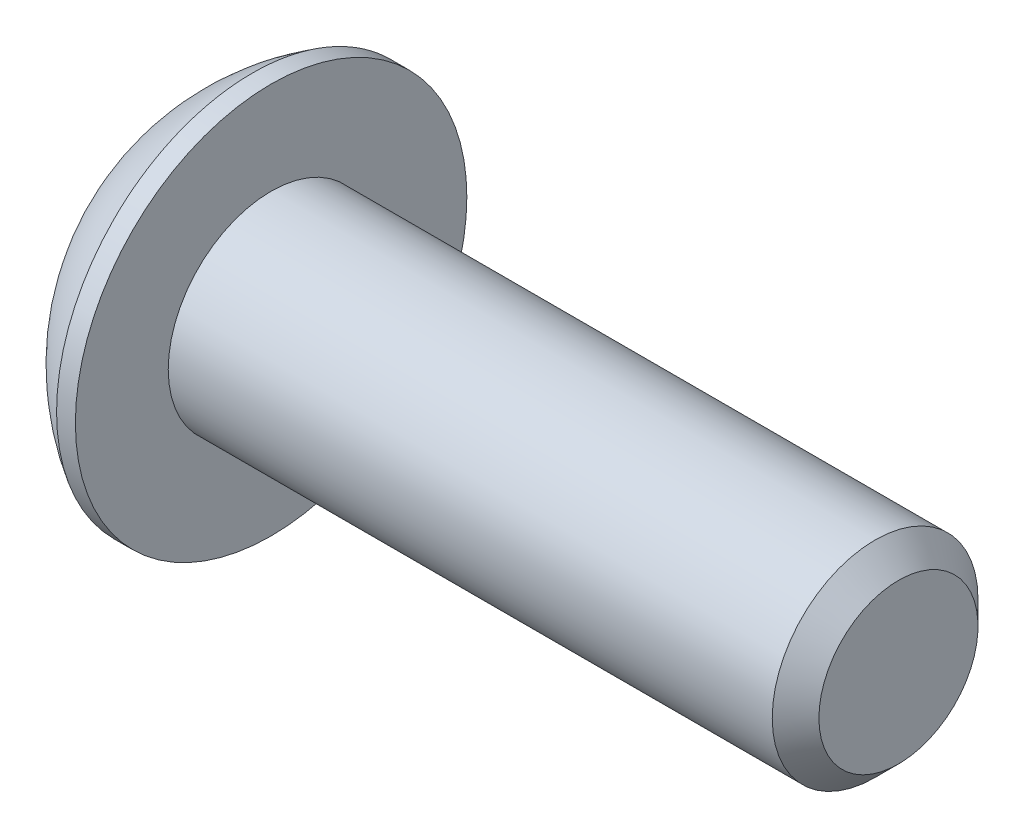
ISO-10303-21;
HEADER;
FILE_DESCRIPTION(('STEP AP214'),'2;1');
FILE_NAME('part.step','',(''),(''),'','','');
FILE_SCHEMA(('AUTOMOTIVE_DESIGN { 1 0 10303 214 1 1 1 1 }'));
ENDSEC;
DATA;
#1=APPLICATION_CONTEXT('core data for automotive mechanical design processes');
#2=APPLICATION_PROTOCOL_DEFINITION('international standard','automotive_design',2000,#1);
#3=PRODUCT_CONTEXT('',#1,'mechanical');
#4=PRODUCT('Part','Part','',(#3));
#5=PRODUCT_RELATED_PRODUCT_CATEGORY('part','',(#4));
#6=PRODUCT_DEFINITION_FORMATION('','',#4);
#7=PRODUCT_DEFINITION_CONTEXT('part definition',#1,'design');
#8=PRODUCT_DEFINITION('design','',#6,#7);
#9=PRODUCT_DEFINITION_SHAPE('','',#8);
#10=(LENGTH_UNIT() NAMED_UNIT(*) SI_UNIT(.MILLI.,.METRE.));
#11=(NAMED_UNIT(*) PLANE_ANGLE_UNIT() SI_UNIT($,.RADIAN.));
#12=(NAMED_UNIT(*) SI_UNIT($,.STERADIAN.) SOLID_ANGLE_UNIT());
#13=UNCERTAINTY_MEASURE_WITH_UNIT(LENGTH_MEASURE(1.E-05),#10,'distance_accuracy_value','');
#14=(GEOMETRIC_REPRESENTATION_CONTEXT(3) GLOBAL_UNCERTAINTY_ASSIGNED_CONTEXT((#13)) GLOBAL_UNIT_ASSIGNED_CONTEXT((#10,
#11,#12)) REPRESENTATION_CONTEXT('',''));
#15=CARTESIAN_POINT('',(0.,0.,0.));
#16=DIRECTION('',(0.,0.,1.));
#17=DIRECTION('',(1.,0.,0.));
#18=AXIS2_PLACEMENT_3D('',#15,#16,#17);
#19=CARTESIAN_POINT('',(1.32080000000034,0.,0.));
#20=DIRECTION('',(-1.,0.,0.));
#21=DIRECTION('',(0.,0.,1.));
#22=AXIS2_PLACEMENT_3D('',#19,#20,#21);
#23=CONICAL_SURFACE('',#22,1.1937999999998,1.04719755119608);
#24=CARTESIAN_POINT('',(2.01004075135902,0.,4.44089209850063E-13));
#25=VERTEX_POINT('',#24);
#26=VERTEX_LOOP('',#25);
#27=FACE_BOUND('',#26,.T.);
#28=CARTESIAN_POINT('',(1.32080000000009,0.,0.));
#29=DIRECTION('',(-1.,0.,0.));
#30=DIRECTION('',(0.,0.,1.));
#31=AXIS2_PLACEMENT_3D('',#28,#29,#30);
#32=CIRCLE('',#31,1.19380000000024);
#33=CARTESIAN_POINT('',(1.32080000000004,-1.03386112703797,0.59690000000006));
#34=VERTEX_POINT('',#33);
#35=CARTESIAN_POINT('',(1.32080000000004,0.,1.19380000000012));
#36=VERTEX_POINT('',#35);
#37=EDGE_CURVE('E18',#34,#36,#32,.T.);
#38=ORIENTED_EDGE('',*,*,#37,.T.);
#39=CARTESIAN_POINT('',(1.32080000000009,0.,0.));
#40=DIRECTION('',(-1.,0.,0.));
#41=DIRECTION('',(0.,0.,1.));
#42=AXIS2_PLACEMENT_3D('',#39,#40,#41);
#43=CIRCLE('',#42,1.19380000000024);
#44=CARTESIAN_POINT('',(1.32080000000004,1.03386112703797,0.596900000000061));
#45=VERTEX_POINT('',#44);
#46=EDGE_CURVE('E139',#36,#45,#43,.T.);
#47=ORIENTED_EDGE('',*,*,#46,.T.);
#48=CARTESIAN_POINT('',(1.32080000000009,0.,0.));
#49=DIRECTION('',(-1.,0.,0.));
#50=DIRECTION('',(0.,0.,1.));
#51=AXIS2_PLACEMENT_3D('',#48,#49,#50);
#52=CIRCLE('',#51,1.19380000000024);
#53=CARTESIAN_POINT('',(1.32080000000004,1.03386112703797,-0.596900000000061));
#54=VERTEX_POINT('',#53);
#55=EDGE_CURVE('E268',#45,#54,#52,.T.);
#56=ORIENTED_EDGE('',*,*,#55,.T.);
#57=CARTESIAN_POINT('',(1.32080000000009,0.,0.));
#58=DIRECTION('',(-1.,0.,0.));
#59=DIRECTION('',(0.,0.,1.));
#60=AXIS2_PLACEMENT_3D('',#57,#58,#59);
#61=CIRCLE('',#60,1.19380000000024);
#62=CARTESIAN_POINT('',(1.32080000000004,1.49457637585666E-12,-1.19380000000012));
#63=VERTEX_POINT('',#62);
#64=EDGE_CURVE('E266',#54,#63,#61,.T.);
#65=ORIENTED_EDGE('',*,*,#64,.T.);
#66=CARTESIAN_POINT('',(1.32080000000009,0.,0.));
#67=DIRECTION('',(-1.,0.,0.));
#68=DIRECTION('',(0.,0.,1.));
#69=AXIS2_PLACEMENT_3D('',#66,#67,#68);
#70=CIRCLE('',#69,1.19380000000024);
#71=CARTESIAN_POINT('',(1.32080000000004,-1.03386112703797,-0.59690000000006));
#72=VERTEX_POINT('',#71);
#73=EDGE_CURVE('E91',#63,#72,#70,.T.);
#74=ORIENTED_EDGE('',*,*,#73,.T.);
#75=CARTESIAN_POINT('',(1.32080000000009,0.,0.));
#76=DIRECTION('',(-1.,0.,0.));
#77=DIRECTION('',(0.,0.,1.));
#78=AXIS2_PLACEMENT_3D('',#75,#76,#77);
#79=CIRCLE('',#78,1.19380000000024);
#80=EDGE_CURVE('E87',#72,#34,#79,.T.);
#81=ORIENTED_EDGE('',*,*,#80,.T.);
#82=EDGE_LOOP('',(#38,#47,#56,#65,#74,#81));
#83=FACE_BOUND('',#82,.T.);
#84=ADVANCED_FACE('F14',(#27,#83),#23,.F.);
#85=CARTESIAN_POINT('',(1.3208,-2.06772225407572,-1.1938));
#86=DIRECTION('',(1.,0.,0.));
#87=DIRECTION('',(0.,0.,-1.));
#88=AXIS2_PLACEMENT_3D('',#85,#86,#87);
#89=PLANE('',#88);
#90=DIRECTION('',(0.,0.5,0.866025403784439));
#91=VECTOR('',#90,1.);
#92=CARTESIAN_POINT('',(1.3208,-1.37848150271715,0.));
#93=LINE('',#92,#91);
#94=CARTESIAN_POINT('',(1.3208,-0.689240751358574,1.1938));
#95=VERTEX_POINT('',#94);
#96=EDGE_CURVE('E99',#95,#34,#93,.F.);
#97=ORIENTED_EDGE('',*,*,#96,.F.);
#98=DIRECTION('',(0.,1.,0.));
#99=VECTOR('',#98,1.);
#100=CARTESIAN_POINT('',(1.3208,-0.689240751358574,1.1938));
#101=LINE('',#100,#99);
#102=EDGE_CURVE('E101',#36,#95,#101,.F.);
#103=ORIENTED_EDGE('',*,*,#102,.F.);
#104=ORIENTED_EDGE('',*,*,#37,.F.);
#105=EDGE_LOOP('',(#97,#103,#104));
#106=FACE_BOUND('',#105,.T.);
#107=ADVANCED_FACE('F97',(#106),#89,.F.);
#108=CARTESIAN_POINT('',(1.3208,-2.06772225407572,-1.1938));
#109=DIRECTION('',(1.,0.,0.));
#110=DIRECTION('',(0.,0.,-1.));
#111=AXIS2_PLACEMENT_3D('',#108,#109,#110);
#112=PLANE('',#111);
#113=DIRECTION('',(0.,-0.5,0.866025403784439));
#114=VECTOR('',#113,1.);
#115=CARTESIAN_POINT('',(1.3208,-0.689240751358574,-1.1938));
#116=LINE('',#115,#114);
#117=CARTESIAN_POINT('',(1.3208,-1.37848150271715,0.));
#118=VERTEX_POINT('',#117);
#119=EDGE_CURVE('E107',#118,#72,#116,.F.);
#120=ORIENTED_EDGE('',*,*,#119,.F.);
#121=DIRECTION('',(0.,0.5,0.866025403784439));
#122=VECTOR('',#121,1.);
#123=CARTESIAN_POINT('',(1.3208,-1.37848150271715,0.));
#124=LINE('',#123,#122);
#125=EDGE_CURVE('E104',#34,#118,#124,.F.);
#126=ORIENTED_EDGE('',*,*,#125,.F.);
#127=ORIENTED_EDGE('',*,*,#80,.F.);
#128=EDGE_LOOP('',(#120,#126,#127));
#129=FACE_BOUND('',#128,.T.);
#130=ADVANCED_FACE('F105',(#129),#112,.F.);
#131=CARTESIAN_POINT('',(1.3208,-2.06772225407572,-1.1938));
#132=DIRECTION('',(1.,0.,0.));
#133=DIRECTION('',(0.,0.,-1.));
#134=AXIS2_PLACEMENT_3D('',#131,#132,#133);
#135=PLANE('',#134);
#136=DIRECTION('',(0.,1.,0.));
#137=VECTOR('',#136,1.);
#138=CARTESIAN_POINT('',(1.3208,0.689240751358577,-1.1938));
#139=LINE('',#138,#137);
#140=CARTESIAN_POINT('',(1.3208,-0.689240751358574,-1.1938));
#141=VERTEX_POINT('',#140);
#142=EDGE_CURVE('E235',#141,#63,#139,.T.);
#143=ORIENTED_EDGE('',*,*,#142,.F.);
#144=DIRECTION('',(0.,-0.5,0.866025403784439));
#145=VECTOR('',#144,1.);
#146=CARTESIAN_POINT('',(1.3208,-0.689240751358574,-1.1938));
#147=LINE('',#146,#145);
#148=EDGE_CURVE('E240',#72,#141,#147,.F.);
#149=ORIENTED_EDGE('',*,*,#148,.F.);
#150=ORIENTED_EDGE('',*,*,#73,.F.);
#151=EDGE_LOOP('',(#143,#149,#150));
#152=FACE_BOUND('',#151,.T.);
#153=ADVANCED_FACE('F182',(#152),#135,.F.);
#154=CARTESIAN_POINT('',(1.3208,-2.06772225407572,-1.1938));
#155=DIRECTION('',(1.,0.,0.));
#156=DIRECTION('',(0.,0.,-1.));
#157=AXIS2_PLACEMENT_3D('',#154,#155,#156);
#158=PLANE('',#157);
#159=DIRECTION('',(0.,-0.5,-0.866025403784439));
#160=VECTOR('',#159,1.);
#161=CARTESIAN_POINT('',(1.3208,1.37848150271715,0.));
#162=LINE('',#161,#160);
#163=CARTESIAN_POINT('',(1.3208,0.689240751358577,-1.1938));
#164=VERTEX_POINT('',#163);
#165=EDGE_CURVE('E226',#164,#54,#162,.F.);
#166=ORIENTED_EDGE('',*,*,#165,.F.);
#167=DIRECTION('',(0.,1.,0.));
#168=VECTOR('',#167,1.);
#169=CARTESIAN_POINT('',(1.3208,0.689240751358577,-1.1938));
#170=LINE('',#169,#168);
#171=EDGE_CURVE('E232',#63,#164,#170,.T.);
#172=ORIENTED_EDGE('',*,*,#171,.F.);
#173=ORIENTED_EDGE('',*,*,#64,.F.);
#174=EDGE_LOOP('',(#166,#172,#173));
#175=FACE_BOUND('',#174,.T.);
#176=ADVANCED_FACE('F178',(#175),#158,.F.);
#177=CARTESIAN_POINT('',(1.3208,-2.06772225407572,-1.1938));
#178=DIRECTION('',(1.,0.,0.));
#179=DIRECTION('',(0.,0.,-1.));
#180=AXIS2_PLACEMENT_3D('',#177,#178,#179);
#181=PLANE('',#180);
#182=DIRECTION('',(0.,0.5,-0.866025403784439));
#183=VECTOR('',#182,1.);
#184=CARTESIAN_POINT('',(1.3208,0.689240751358576,1.1938));
#185=LINE('',#184,#183);
#186=CARTESIAN_POINT('',(1.3208,1.37848150271715,0.));
#187=VERTEX_POINT('',#186);
#188=EDGE_CURVE('E213',#187,#45,#185,.F.);
#189=ORIENTED_EDGE('',*,*,#188,.F.);
#190=DIRECTION('',(0.,-0.5,-0.866025403784439));
#191=VECTOR('',#190,1.);
#192=CARTESIAN_POINT('',(1.3208,1.37848150271715,0.));
#193=LINE('',#192,#191);
#194=EDGE_CURVE('E224',#54,#187,#193,.F.);
#195=ORIENTED_EDGE('',*,*,#194,.F.);
#196=ORIENTED_EDGE('',*,*,#55,.F.);
#197=EDGE_LOOP('',(#189,#195,#196));
#198=FACE_BOUND('',#197,.T.);
#199=ADVANCED_FACE('F174',(#198),#181,.F.);
#200=CARTESIAN_POINT('',(1.3208,-2.06772225407572,-1.1938));
#201=DIRECTION('',(1.,0.,0.));
#202=DIRECTION('',(0.,0.,-1.));
#203=AXIS2_PLACEMENT_3D('',#200,#201,#202);
#204=PLANE('',#203);
#205=DIRECTION('',(0.,1.,0.));
#206=VECTOR('',#205,1.);
#207=CARTESIAN_POINT('',(1.3208,-0.689240751358574,1.1938));
#208=LINE('',#207,#206);
#209=CARTESIAN_POINT('',(1.3208,0.689240751358576,1.1938));
#210=VERTEX_POINT('',#209);
#211=EDGE_CURVE('E116',#210,#36,#208,.F.);
#212=ORIENTED_EDGE('',*,*,#211,.F.);
#213=DIRECTION('',(0.,0.5,-0.866025403784439));
#214=VECTOR('',#213,1.);
#215=CARTESIAN_POINT('',(1.3208,0.689240751358576,1.1938));
#216=LINE('',#215,#214);
#217=EDGE_CURVE('E216',#45,#210,#216,.F.);
#218=ORIENTED_EDGE('',*,*,#217,.F.);
#219=ORIENTED_EDGE('',*,*,#46,.F.);
#220=EDGE_LOOP('',(#212,#218,#219));
#221=FACE_BOUND('',#220,.T.);
#222=ADVANCED_FACE('F170',(#221),#204,.F.);
#223=CARTESIAN_POINT('',(1.3208,-0.689240751358574,1.1938));
#224=DIRECTION('',(0.,0.,-1.));
#225=DIRECTION('',(0.,1.,0.));
#226=AXIS2_PLACEMENT_3D('',#223,#224,#225);
#227=PLANE('',#226);
#228=DIRECTION('',(0.,1.,0.));
#229=VECTOR('',#228,1.);
#230=CARTESIAN_POINT('',(0.,0.,1.1938));
#231=LINE('',#230,#229);
#232=CARTESIAN_POINT('',(0.,0.689240751358577,1.1938));
#233=VERTEX_POINT('',#232);
#234=CARTESIAN_POINT('',(0.,-0.689240751358574,1.1938));
#235=VERTEX_POINT('',#234);
#236=EDGE_CURVE('E228',#233,#235,#231,.F.);
#237=ORIENTED_EDGE('',*,*,#236,.F.);
#238=DIRECTION('',(1.,0.,0.));
#239=VECTOR('',#238,1.);
#240=CARTESIAN_POINT('',(1.3208,0.689240751358576,1.1938));
#241=LINE('',#240,#239);
#242=EDGE_CURVE('E220',#210,#233,#241,.F.);
#243=ORIENTED_EDGE('',*,*,#242,.F.);
#244=ORIENTED_EDGE('',*,*,#211,.T.);
#245=ORIENTED_EDGE('',*,*,#102,.T.);
#246=DIRECTION('',(1.,0.,0.));
#247=VECTOR('',#246,1.);
#248=CARTESIAN_POINT('',(1.3208,-0.689240751358574,1.1938));
#249=LINE('',#248,#247);
#250=EDGE_CURVE('E110',#235,#95,#249,.T.);
#251=ORIENTED_EDGE('',*,*,#250,.F.);
#252=EDGE_LOOP('',(#237,#243,#244,#245,#251));
#253=FACE_BOUND('',#252,.T.);
#254=ADVANCED_FACE('F167',(#253),#227,.T.);
#255=CARTESIAN_POINT('',(1.3208,-1.37848150271715,0.));
#256=DIRECTION('',(0.,0.866025403784439,-0.5));
#257=DIRECTION('',(0.,0.5,0.866025403784439));
#258=AXIS2_PLACEMENT_3D('',#255,#256,#257);
#259=PLANE('',#258);
#260=DIRECTION('',(0.,-0.5,-0.866025403784439));
#261=VECTOR('',#260,1.);
#262=CARTESIAN_POINT('',(0.,-0.689240751358574,1.1938));
#263=LINE('',#262,#261);
#264=CARTESIAN_POINT('',(0.,-1.37848150271715,0.));
#265=VERTEX_POINT('',#264);
#266=EDGE_CURVE('E249',#235,#265,#263,.T.);
#267=ORIENTED_EDGE('',*,*,#266,.F.);
#268=ORIENTED_EDGE('',*,*,#250,.T.);
#269=ORIENTED_EDGE('',*,*,#96,.T.);
#270=ORIENTED_EDGE('',*,*,#125,.T.);
#271=DIRECTION('',(1.,0.,0.));
#272=VECTOR('',#271,1.);
#273=CARTESIAN_POINT('',(1.3208,-1.37848150271715,0.));
#274=LINE('',#273,#272);
#275=EDGE_CURVE('E119',#265,#118,#274,.T.);
#276=ORIENTED_EDGE('',*,*,#275,.F.);
#277=EDGE_LOOP('',(#267,#268,#269,#270,#276));
#278=FACE_BOUND('',#277,.T.);
#279=ADVANCED_FACE('F114',(#278),#259,.T.);
#280=CARTESIAN_POINT('',(1.3208,-0.689240751358574,-1.1938));
#281=DIRECTION('',(0.,0.866025403784439,0.5));
#282=DIRECTION('',(0.,-0.5,0.866025403784439));
#283=AXIS2_PLACEMENT_3D('',#280,#281,#282);
#284=PLANE('',#283);
#285=DIRECTION('',(0.,0.5,-0.866025403784439));
#286=VECTOR('',#285,1.);
#287=CARTESIAN_POINT('',(0.,-1.37848150271715,0.));
#288=LINE('',#287,#286);
#289=CARTESIAN_POINT('',(0.,-0.689240751358574,-1.1938));
#290=VERTEX_POINT('',#289);
#291=EDGE_CURVE('E247',#265,#290,#288,.T.);
#292=ORIENTED_EDGE('',*,*,#291,.F.);
#293=ORIENTED_EDGE('',*,*,#275,.T.);
#294=ORIENTED_EDGE('',*,*,#119,.T.);
#295=ORIENTED_EDGE('',*,*,#148,.T.);
#296=DIRECTION('',(1.,0.,0.));
#297=VECTOR('',#296,1.);
#298=CARTESIAN_POINT('',(1.3208,-0.689240751358574,-1.1938));
#299=LINE('',#298,#297);
#300=EDGE_CURVE('E231',#290,#141,#299,.T.);
#301=ORIENTED_EDGE('',*,*,#300,.F.);
#302=EDGE_LOOP('',(#292,#293,#294,#295,#301));
#303=FACE_BOUND('',#302,.T.);
#304=ADVANCED_FACE('F160',(#303),#284,.T.);
#305=CARTESIAN_POINT('',(1.3208,0.689240751358577,-1.1938));
#306=DIRECTION('',(0.,0.,1.));
#307=DIRECTION('',(1.,0.,0.));
#308=AXIS2_PLACEMENT_3D('',#305,#306,#307);
#309=PLANE('',#308);
#310=DIRECTION('',(0.,1.,0.));
#311=VECTOR('',#310,1.);
#312=CARTESIAN_POINT('',(0.,0.,-1.1938));
#313=LINE('',#312,#311);
#314=CARTESIAN_POINT('',(0.,0.689240751358577,-1.1938));
#315=VERTEX_POINT('',#314);
#316=EDGE_CURVE('E258',#290,#315,#313,.T.);
#317=ORIENTED_EDGE('',*,*,#316,.F.);
#318=ORIENTED_EDGE('',*,*,#300,.T.);
#319=ORIENTED_EDGE('',*,*,#142,.T.);
#320=ORIENTED_EDGE('',*,*,#171,.T.);
#321=DIRECTION('',(1.,0.,0.));
#322=VECTOR('',#321,1.);
#323=CARTESIAN_POINT('',(1.3208,0.689240751358577,-1.1938));
#324=LINE('',#323,#322);
#325=EDGE_CURVE('E217',#315,#164,#324,.T.);
#326=ORIENTED_EDGE('',*,*,#325,.F.);
#327=EDGE_LOOP('',(#317,#318,#319,#320,#326));
#328=FACE_BOUND('',#327,.T.);
#329=ADVANCED_FACE('F157',(#328),#309,.T.);
#330=CARTESIAN_POINT('',(1.3208,1.37848150271715,0.));
#331=DIRECTION('',(0.,-0.866025403784439,0.5));
#332=DIRECTION('',(0.,-0.5,-0.866025403784439));
#333=AXIS2_PLACEMENT_3D('',#330,#331,#332);
#334=PLANE('',#333);
#335=DIRECTION('',(0.,0.5,0.866025403784439));
#336=VECTOR('',#335,1.);
#337=CARTESIAN_POINT('',(0.,0.689240751358577,-1.1938));
#338=LINE('',#337,#336);
#339=CARTESIAN_POINT('',(0.,1.37848150271715,0.));
#340=VERTEX_POINT('',#339);
#341=EDGE_CURVE('E261',#315,#340,#338,.T.);
#342=ORIENTED_EDGE('',*,*,#341,.F.);
#343=ORIENTED_EDGE('',*,*,#325,.T.);
#344=ORIENTED_EDGE('',*,*,#165,.T.);
#345=ORIENTED_EDGE('',*,*,#194,.T.);
#346=DIRECTION('',(1.,0.,0.));
#347=VECTOR('',#346,1.);
#348=CARTESIAN_POINT('',(1.3208,1.37848150271715,0.));
#349=LINE('',#348,#347);
#350=EDGE_CURVE('E33',#340,#187,#349,.T.);
#351=ORIENTED_EDGE('',*,*,#350,.F.);
#352=EDGE_LOOP('',(#342,#343,#344,#345,#351));
#353=FACE_BOUND('',#352,.T.);
#354=ADVANCED_FACE('F153',(#353),#334,.T.);
#355=CARTESIAN_POINT('',(1.3208,0.689240751358576,1.1938));
#356=DIRECTION('',(0.,-0.866025403784439,-0.5));
#357=DIRECTION('',(0.,0.5,-0.866025403784439));
#358=AXIS2_PLACEMENT_3D('',#355,#356,#357);
#359=PLANE('',#358);
#360=DIRECTION('',(0.,-0.5,0.866025403784439));
#361=VECTOR('',#360,1.);
#362=CARTESIAN_POINT('',(0.,1.37848150271715,0.));
#363=LINE('',#362,#361);
#364=EDGE_CURVE('E138',#340,#233,#363,.T.);
#365=ORIENTED_EDGE('',*,*,#364,.F.);
#366=ORIENTED_EDGE('',*,*,#350,.T.);
#367=ORIENTED_EDGE('',*,*,#188,.T.);
#368=ORIENTED_EDGE('',*,*,#217,.T.);
#369=ORIENTED_EDGE('',*,*,#242,.T.);
#370=EDGE_LOOP('',(#365,#366,#367,#368,#369));
#371=FACE_BOUND('',#370,.T.);
#372=ADVANCED_FACE('F149',(#371),#359,.T.);
#373=CARTESIAN_POINT('',(0.,0.,0.));
#374=DIRECTION('',(-1.,0.,0.));
#375=DIRECTION('',(0.,0.,1.));
#376=AXIS2_PLACEMENT_3D('',#373,#374,#375);
#377=PLANE('',#376);
#378=ORIENTED_EDGE('',*,*,#341,.T.);
#379=ORIENTED_EDGE('',*,*,#364,.T.);
#380=ORIENTED_EDGE('',*,*,#236,.T.);
#381=ORIENTED_EDGE('',*,*,#266,.T.);
#382=ORIENTED_EDGE('',*,*,#291,.T.);
#383=ORIENTED_EDGE('',*,*,#316,.T.);
#384=EDGE_LOOP('',(#378,#379,#380,#381,#382,#383));
#385=FACE_BOUND('',#384,.T.);
#386=CARTESIAN_POINT('',(0.,1.9812,0.));
#387=CARTESIAN_POINT('',(0.,1.9811996664299,0.0556258831179429));
#388=CARTESIAN_POINT('',(0.,1.97885520380442,0.111261989398606));
#389=CARTESIAN_POINT('',(0.,1.96949260169541,0.222149719830458));
#390=CARTESIAN_POINT('',(0.,1.96247308239606,0.277401225602896));
#391=CARTESIAN_POINT('',(0.,1.94379192841039,0.387209508139748));
#392=CARTESIAN_POINT('',(-1.85322098412163E-13,1.93212292489526,0.441765039546366));
#393=CARTESIAN_POINT('',(1.86340516395781E-13,1.90422331175315,0.549729449347493));
#394=CARTESIAN_POINT('',(6.9454338814387E-13,1.88798900035338,0.603137359208869));
#395=CARTESIAN_POINT('',(1.15501971975443E-12,1.832662144765,0.760839131321828));
#396=CARTESIAN_POINT('',(0.,1.78690023648845,0.86287643357543));
#397=CARTESIAN_POINT('',(0.,1.67887358150667,1.05780719540872));
#398=CARTESIAN_POINT('',(9.54252846156157E-13,1.6166082074585,1.15070030720801));
#399=CARTESIAN_POINT('',(5.94775737193293E-13,1.51224157140982,1.28116890915698));
#400=CARTESIAN_POINT('',(1.63135429314554E-13,1.47559703943539,1.32320451127027));
#401=CARTESIAN_POINT('',(-1.62111198585679E-13,1.39893832619713,1.40400288695709));
#402=CARTESIAN_POINT('',(0.,1.35892742784698,1.44276877695455));
#403=CARTESIAN_POINT('',(1.13736409396491E-13,1.23416504602197,1.55382272417904));
#404=CARTESIAN_POINT('',(0.,1.14466125559859,1.62089527952111));
#405=CARTESIAN_POINT('',(0.,0.955712144178161,1.73902218081179));
#406=CARTESIAN_POINT('',(0.,0.856267198233561,1.79007713076008));
#407=CARTESIAN_POINT('',(0.,0.65020634591084,1.87477637530954));
#408=CARTESIAN_POINT('',(0.,0.543590516134851,1.90842085586266));
#409=CARTESIAN_POINT('',(0.,0.326226155292014,1.95733039300656));
#410=CARTESIAN_POINT('',(0.,0.215477602157926,1.97259535144288));
#411=CARTESIAN_POINT('',(0.,-0.00701040587545002,1.98431697865418));
#412=CARTESIAN_POINT('',(0.,-0.118749860774737,1.98077364742916));
#413=CARTESIAN_POINT('',(0.,-0.340050178355489,1.95497485623824));
#414=CARTESIAN_POINT('',(0.,-0.449611052668259,1.93271949620217));
#415=CARTESIAN_POINT('',(0.,-0.663431110729177,1.87014138774524));
#416=CARTESIAN_POINT('',(0.,-0.767690237838523,1.82981844635272));
#417=CARTESIAN_POINT('',(0.,-0.968005760719348,1.73219968377096));
#418=CARTESIAN_POINT('',(0.,-1.0640618469811,1.6749032225164));
#419=CARTESIAN_POINT('',(0.,-1.19980276751283,1.57757371205873));
#420=CARTESIAN_POINT('',(0.,-1.24366557129214,1.54322665019466));
#421=CARTESIAN_POINT('',(0.,-1.32838995706696,1.47093063174264));
#422=CARTESIAN_POINT('',(0.,-1.36924860178706,1.43297823102439));
#423=CARTESIAN_POINT('',(0.,-1.48674671849223,1.31419842051172));
#424=CARTESIAN_POINT('',(0.,-1.55842832343237,1.22836221289311));
#425=CARTESIAN_POINT('',(0.,-1.6863396856475,1.04586168272493));
#426=CARTESIAN_POINT('',(0.,-1.7425700302488,0.949197771949769));
#427=CARTESIAN_POINT('',(0.,-1.8141614250401,0.798182600298679));
#428=CARTESIAN_POINT('',(0.,-1.83591780585875,0.746776203847787));
#429=CARTESIAN_POINT('',(0.,-1.87500754181092,0.642341081688632));
#430=CARTESIAN_POINT('',(0.,-1.89234447645404,0.589313708122843));
#431=CARTESIAN_POINT('',(0.,-1.92246053433555,0.482076273028391));
#432=CARTESIAN_POINT('',(0.,-1.93524685475118,0.427868224257506));
#433=CARTESIAN_POINT('',(0.,-1.95620937250494,0.318578151844607));
#434=CARTESIAN_POINT('',(0.,-1.96438692958147,0.263496390912868));
#435=CARTESIAN_POINT('',(0.,-1.97388528284653,0.173607715038555));
#436=CARTESIAN_POINT('',(0.,-1.97662743364426,0.138944718024995));
#437=CARTESIAN_POINT('',(0.,-1.98028489645283,0.069522478256699));
#438=CARTESIAN_POINT('',(0.,-1.98120020846367,0.0347632355019625));
#439=CARTESIAN_POINT('',(0.,-1.9811996664299,-0.0556258831179437));
#440=CARTESIAN_POINT('',(0.,-1.97885520380442,-0.111261989398607));
#441=CARTESIAN_POINT('',(0.,-1.96949260169541,-0.222149719830459));
#442=CARTESIAN_POINT('',(0.,-1.96247308239605,-0.277401225602897));
#443=CARTESIAN_POINT('',(0.,-1.94379192841039,-0.387209508139749));
#444=CARTESIAN_POINT('',(-1.85273829369933E-13,-1.93212292489526,-0.441765039546367));
#445=CARTESIAN_POINT('',(1.86292208101257E-13,-1.90422331175315,-0.549729449347495));
#446=CARTESIAN_POINT('',(6.94526512411752E-13,-1.88798900035338,-0.603137359208872));
#447=CARTESIAN_POINT('',(1.15505339077404E-12,-1.83266214476501,-0.760839131321831));
#448=CARTESIAN_POINT('',(0.,-1.78690023648846,-0.862876433575432));
#449=CARTESIAN_POINT('',(0.,-1.67887358150667,-1.05780719540872));
#450=CARTESIAN_POINT('',(9.54248949793369E-13,-1.6166082074585,-1.15070030720801));
#451=CARTESIAN_POINT('',(5.94777687927534E-13,-1.51224157140982,-1.28116890915698));
#452=CARTESIAN_POINT('',(1.63138929838936E-13,-1.4755970394354,-1.32320451127027));
#453=CARTESIAN_POINT('',(-1.62114695735028E-13,-1.39893832619713,-1.40400288695709));
#454=CARTESIAN_POINT('',(0.,-1.35892742784699,-1.44276877695455));
#455=CARTESIAN_POINT('',(1.13760471433616E-13,-1.23416504602197,-1.55382272417904));
#456=CARTESIAN_POINT('',(0.,-1.14466125559859,-1.62089527952111));
#457=CARTESIAN_POINT('',(0.,-0.95571214417816,-1.73902218081179));
#458=CARTESIAN_POINT('',(0.,-0.856267198233559,-1.79007713076007));
#459=CARTESIAN_POINT('',(0.,-0.650206345910841,-1.87477637530954));
#460=CARTESIAN_POINT('',(0.,-0.543590516134854,-1.90842085586267));
#461=CARTESIAN_POINT('',(0.,-0.326226155292018,-1.95733039300657));
#462=CARTESIAN_POINT('',(0.,-0.215477602157928,-1.97259535144288));
#463=CARTESIAN_POINT('',(0.,0.00701040587544881,-1.98431697865418));
#464=CARTESIAN_POINT('',(0.,0.118749860774737,-1.98077364742916));
#465=CARTESIAN_POINT('',(0.,0.340050178355489,-1.95497485623824));
#466=CARTESIAN_POINT('',(0.,0.44961105266826,-1.93271949620218));
#467=CARTESIAN_POINT('',(0.,0.663431110729178,-1.87014138774524));
#468=CARTESIAN_POINT('',(0.,0.767690237838524,-1.82981844635272));
#469=CARTESIAN_POINT('',(0.,0.968005760719347,-1.73219968377096));
#470=CARTESIAN_POINT('',(0.,1.0640618469811,-1.67490322251639));
#471=CARTESIAN_POINT('',(0.,1.19980276751283,-1.57757371205873));
#472=CARTESIAN_POINT('',(0.,1.24366557129214,-1.54322665019465));
#473=CARTESIAN_POINT('',(0.,1.32838995706696,-1.47093063174263));
#474=CARTESIAN_POINT('',(0.,1.36924860178706,-1.43297823102439));
#475=CARTESIAN_POINT('',(0.,1.48674671849223,-1.31419842051172));
#476=CARTESIAN_POINT('',(0.,1.55842832343237,-1.22836221289311));
#477=CARTESIAN_POINT('',(0.,1.6863396856475,-1.04586168272493));
#478=CARTESIAN_POINT('',(0.,1.7425700302488,-0.94919777194977));
#479=CARTESIAN_POINT('',(0.,1.8141614250401,-0.798182600298679));
#480=CARTESIAN_POINT('',(0.,1.83591780585875,-0.746776203847786));
#481=CARTESIAN_POINT('',(0.,1.87500754181092,-0.642341081688631));
#482=CARTESIAN_POINT('',(0.,1.89234447645404,-0.589313708122842));
#483=CARTESIAN_POINT('',(0.,1.92246053433555,-0.482076273028391));
#484=CARTESIAN_POINT('',(0.,1.93524685475118,-0.427868224257506));
#485=CARTESIAN_POINT('',(0.,1.95620937250494,-0.318578151844607));
#486=CARTESIAN_POINT('',(0.,1.96438692958147,-0.263496390912867));
#487=CARTESIAN_POINT('',(0.,1.97388528284653,-0.173607715038554));
#488=CARTESIAN_POINT('',(0.,1.97662743364426,-0.138944718024995));
#489=CARTESIAN_POINT('',(0.,1.98028489645283,-0.0695224782566994));
#490=CARTESIAN_POINT('',(0.,1.98120020846367,-0.0347632355019633));
#491=CARTESIAN_POINT('',(0.,1.9812,0.));
#492=B_SPLINE_CURVE_WITH_KNOTS('',3,(#386,#387,#388,#389,#390,#391,#392,#393,#394,#395,#396,
#397,#398,#399,#400,#401,#402,#403,#404,#405,#406,#407,#408,#409,#410,#411,#412,#413,#414,#415,
#416,#417,#418,#419,#420,#421,#422,#423,#424,#425,#426,#427,#428,#429,#430,#431,#432,#433,#434,
#435,#436,#437,#438,#439,#440,#441,#442,#443,#444,#445,#446,#447,#448,#449,#450,#451,#452,#453,
#454,#455,#456,#457,#458,#459,#460,#461,#462,#463,#464,#465,#466,#467,#468,#469,#470,#471,#472,
#473,#474,#475,#476,#477,#478,#479,#480,#481,#482,#483,#484,#485,#486,#487,#488,#489,#490,#491),
.UNSPECIFIED.,.T.,.F.,(4,2,2,2,2,2,2,2,2,2,2,2,2,2,2,2,2,2,2,2,2,2,2,2,2,2,2,2,2,2,2,2,2,2,2,2,
2,2,2,2,2,2,2,2,2,2,2,2,2,2,2,2,4),(0.,0.166845646007828,0.333740557374256,0.500901034367694,
0.668197445942387,1.00199278686282,1.33580081809885,1.50292354032982,1.6698851310853,
2.00370118900129,2.33750465770544,2.67130456115909,3.00510624723801,3.33890793331696,
3.67270783677065,4.00651130547476,4.34032736339026,4.50728895414554,4.67441167637632,
5.0082197076126,5.34201504853333,5.50931146010827,5.67647193710192,5.84336684846844,
6.01021249447641,6.11448220058334,6.21875190669029,6.38559755269811,6.55249246406454,
6.71965294105798,6.88694935263267,7.22074469355311,7.55455272478914,7.72167544702011,
7.88863703777559,8.22245309569158,8.55625656439573,8.89005646784938,9.2238581539283,
9.55765984000725,9.89145974346094,10.225263212165,10.5590792700806,10.7260408608358,
10.8931635830666,11.2269716143029,11.5607669552236,11.7280633667986,11.8952238437922,
12.0621187551587,12.2289644011667,12.3332341072736,12.4375038133806),.UNSPECIFIED.);
#493=CARTESIAN_POINT('',(0.,1.9812,0.));
#494=VERTEX_POINT('',#493);
#495=EDGE_CURVE('E131',#494,#494,#492,.T.);
#496=ORIENTED_EDGE('',*,*,#495,.F.);
#497=EDGE_LOOP('',(#496));
#498=FACE_BOUND('',#497,.T.);
#499=ADVANCED_FACE('F145',(#385,#498),#377,.T.);
#500=CARTESIAN_POINT('',(4.13385,0.,0.));
#501=DIRECTION('',(0.,1.,0.));
#502=DIRECTION('',(1.,0.,0.));
#503=AXIS2_PLACEMENT_3D('',#500,#501,#502);
#504=SPHERICAL_SURFACE('',#503,4.58408870578439);
#505=CARTESIAN_POINT('',(1.8288,0.,0.));
#506=DIRECTION('',(-1.,0.,0.));
#507=DIRECTION('',(0.,0.,1.));
#508=AXIS2_PLACEMENT_3D('',#505,#506,#507);
#509=CIRCLE('',#508,3.9624);
#510=CARTESIAN_POINT('',(1.8288,0.,3.9624));
#511=VERTEX_POINT('',#510);
#512=EDGE_CURVE('E128',#511,#511,#509,.F.);
#513=ORIENTED_EDGE('',*,*,#512,.F.);
#514=EDGE_LOOP('',(#513));
#515=FACE_BOUND('',#514,.T.);
#516=ORIENTED_EDGE('',*,*,#495,.T.);
#517=EDGE_LOOP('',(#516));
#518=FACE_BOUND('',#517,.T.);
#519=ADVANCED_FACE('F141',(#515,#518),#504,.T.);
#520=CARTESIAN_POINT('',(14.9098,0.,0.));
#521=DIRECTION('',(-1.,0.,0.));
#522=DIRECTION('',(0.,0.,1.));
#523=AXIS2_PLACEMENT_3D('',#520,#521,#522);
#524=PLANE('',#523);
#525=CARTESIAN_POINT('',(14.9098000000549,0.,0.));
#526=DIRECTION('',(-1.,0.,0.));
#527=DIRECTION('',(0.,0.,1.));
#528=AXIS2_PLACEMENT_3D('',#525,#526,#527);
#529=CIRCLE('',#528,1.61035999997239);
#530=CARTESIAN_POINT('',(14.9098000000549,0.,1.61035999997239));
#531=VERTEX_POINT('',#530);
#532=EDGE_CURVE('E125',#531,#531,#529,.T.);
#533=ORIENTED_EDGE('',*,*,#532,.F.);
#534=EDGE_LOOP('',(#533));
#535=FACE_BOUND('',#534,.T.);
#536=ADVANCED_FACE('F276',(#535),#524,.F.);
#537=CARTESIAN_POINT('',(0.,0.,0.));
#538=DIRECTION('',(-1.,0.,0.));
#539=DIRECTION('',(0.,0.,1.));
#540=AXIS2_PLACEMENT_3D('',#537,#538,#539);
#541=CYLINDRICAL_SURFACE('',#540,3.9624);
#542=ORIENTED_EDGE('',*,*,#512,.T.);
#543=EDGE_LOOP('',(#542));
#544=FACE_BOUND('',#543,.T.);
#545=CARTESIAN_POINT('',(2.2098,0.,0.));
#546=DIRECTION('',(-1.,0.,0.));
#547=DIRECTION('',(0.,0.,1.));
#548=AXIS2_PLACEMENT_3D('',#545,#546,#547);
#549=CIRCLE('',#548,3.9624);
#550=CARTESIAN_POINT('',(2.2098,0.,3.9624));
#551=VERTEX_POINT('',#550);
#552=EDGE_CURVE('E122',#551,#551,#549,.T.);
#553=ORIENTED_EDGE('',*,*,#552,.T.);
#554=EDGE_LOOP('',(#553));
#555=FACE_BOUND('',#554,.T.);
#556=ADVANCED_FACE('F281',(#544,#555),#541,.T.);
#557=CARTESIAN_POINT('',(14.4373599999881,0.,0.));
#558=DIRECTION('',(-1.,0.,0.));
#559=DIRECTION('',(0.,0.,1.));
#560=AXIS2_PLACEMENT_3D('',#557,#558,#559);
#561=CONICAL_SURFACE('',#560,2.08280000003924,0.785398163397448);
#562=CARTESIAN_POINT('',(14.43736,0.,0.));
#563=DIRECTION('',(-1.,0.,0.));
#564=DIRECTION('',(0.,0.,1.));
#565=AXIS2_PLACEMENT_3D('',#562,#563,#564);
#566=CIRCLE('',#565,2.0828);
#567=CARTESIAN_POINT('',(14.43736,0.,2.0828));
#568=VERTEX_POINT('',#567);
#569=EDGE_CURVE('E24',#568,#568,#566,.T.);
#570=ORIENTED_EDGE('',*,*,#569,.F.);
#571=EDGE_LOOP('',(#570));
#572=FACE_BOUND('',#571,.T.);
#573=ORIENTED_EDGE('',*,*,#532,.T.);
#574=EDGE_LOOP('',(#573));
#575=FACE_BOUND('',#574,.T.);
#576=ADVANCED_FACE('F202',(#572,#575),#561,.T.);
#577=CARTESIAN_POINT('',(2.2098,2.0828,0.));
#578=DIRECTION('',(-1.,0.,0.));
#579=DIRECTION('',(0.,0.,1.));
#580=AXIS2_PLACEMENT_3D('',#577,#578,#579);
#581=PLANE('',#580);
#582=CARTESIAN_POINT('',(2.2098,0.,0.));
#583=DIRECTION('',(-1.,0.,0.));
#584=DIRECTION('',(0.,0.,1.));
#585=AXIS2_PLACEMENT_3D('',#582,#583,#584);
#586=CIRCLE('',#585,2.0828);
#587=CARTESIAN_POINT('',(2.2098,0.,2.0828));
#588=VERTEX_POINT('',#587);
#589=EDGE_CURVE('E9',#588,#588,#586,.F.);
#590=ORIENTED_EDGE('',*,*,#589,.F.);
#591=EDGE_LOOP('',(#590));
#592=FACE_BOUND('',#591,.T.);
#593=ORIENTED_EDGE('',*,*,#552,.F.);
#594=EDGE_LOOP('',(#593));
#595=FACE_BOUND('',#594,.T.);
#596=ADVANCED_FACE('F197',(#592,#595),#581,.F.);
#597=CARTESIAN_POINT('',(0.,0.,0.));
#598=DIRECTION('',(-1.,0.,0.));
#599=DIRECTION('',(0.,0.,1.));
#600=AXIS2_PLACEMENT_3D('',#597,#598,#599);
#601=CYLINDRICAL_SURFACE('',#600,2.0828);
#602=ORIENTED_EDGE('',*,*,#589,.T.);
#603=EDGE_LOOP('',(#602));
#604=FACE_BOUND('',#603,.T.);
#605=ORIENTED_EDGE('',*,*,#569,.T.);
#606=EDGE_LOOP('',(#605));
#607=FACE_BOUND('',#606,.T.);
#608=ADVANCED_FACE('F16',(#604,#607),#601,.T.);
#609=CLOSED_SHELL('',(#84,#107,#130,#153,#176,#199,#222,#254,#279,#304,#329,#354,#372,#499,#519,
#536,#556,#576,#596,#608));
#610=MANIFOLD_SOLID_BREP('B1',#609);
#611=ADVANCED_BREP_SHAPE_REPRESENTATION('',(#18,#610),#14);
#612=SHAPE_DEFINITION_REPRESENTATION(#9,#611);
ENDSEC;
END-ISO-10303-21;
